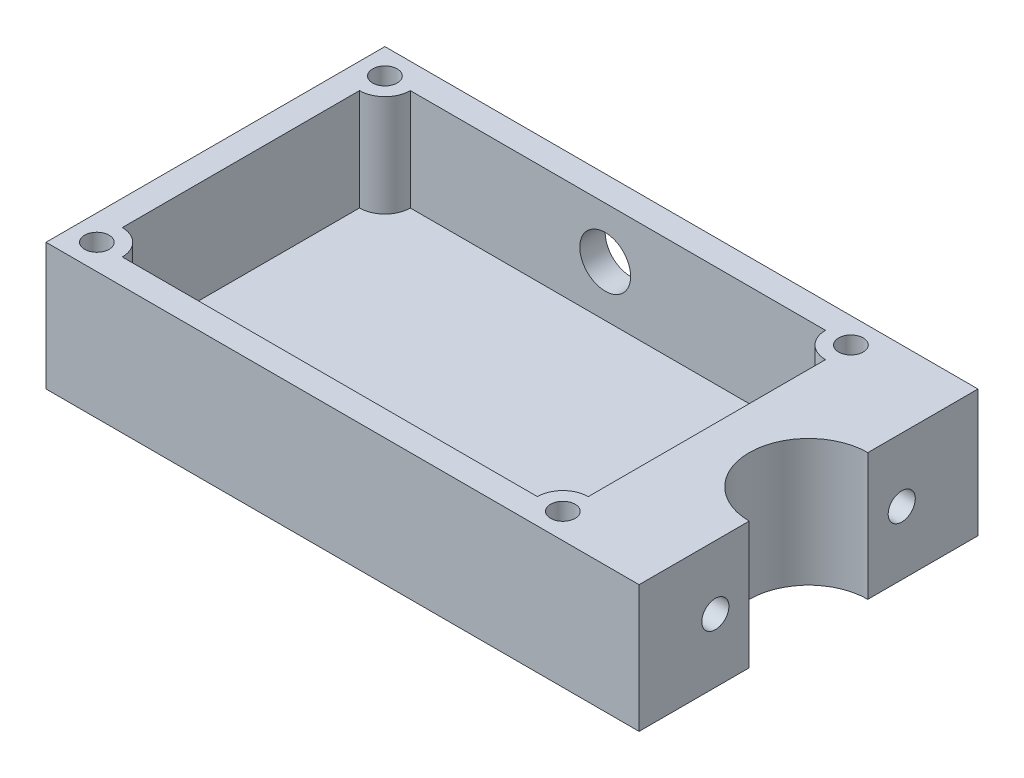
ISO-10303-21;
HEADER;
FILE_DESCRIPTION(('STEP AP214'),'2;1');
FILE_NAME('part.step','',(''),(''),'','','');
FILE_SCHEMA(('AUTOMOTIVE_DESIGN { 1 0 10303 214 1 1 1 1 }'));
ENDSEC;
DATA;
#1=APPLICATION_CONTEXT('core data for automotive mechanical design processes');
#2=APPLICATION_PROTOCOL_DEFINITION('international standard','automotive_design',2000,#1);
#3=PRODUCT_CONTEXT('',#1,'mechanical');
#4=PRODUCT('Part','Part','',(#3));
#5=PRODUCT_RELATED_PRODUCT_CATEGORY('part','',(#4));
#6=PRODUCT_DEFINITION_FORMATION('','',#4);
#7=PRODUCT_DEFINITION_CONTEXT('part definition',#1,'design');
#8=PRODUCT_DEFINITION('design','',#6,#7);
#9=PRODUCT_DEFINITION_SHAPE('','',#8);
#10=(LENGTH_UNIT() NAMED_UNIT(*) SI_UNIT(.MILLI.,.METRE.));
#11=(NAMED_UNIT(*) PLANE_ANGLE_UNIT() SI_UNIT($,.RADIAN.));
#12=(NAMED_UNIT(*) SI_UNIT($,.STERADIAN.) SOLID_ANGLE_UNIT());
#13=UNCERTAINTY_MEASURE_WITH_UNIT(LENGTH_MEASURE(1.E-05),#10,'distance_accuracy_value','');
#14=(GEOMETRIC_REPRESENTATION_CONTEXT(3) GLOBAL_UNCERTAINTY_ASSIGNED_CONTEXT((#13)) GLOBAL_UNIT_ASSIGNED_CONTEXT((#10,
#11,#12)) REPRESENTATION_CONTEXT('',''));
#15=CARTESIAN_POINT('',(0.,0.,0.));
#16=DIRECTION('',(0.,0.,1.));
#17=DIRECTION('',(1.,0.,0.));
#18=AXIS2_PLACEMENT_3D('',#15,#16,#17);
#19=CARTESIAN_POINT('',(-35.001,7.49999999999999,11.));
#20=DIRECTION('',(1.,0.,0.));
#21=DIRECTION('',(0.,0.,-1.));
#22=AXIS2_PLACEMENT_3D('',#19,#20,#21);
#23=CYLINDRICAL_SURFACE('',#22,1.6);
#24=CARTESIAN_POINT('',(35.,7.49999999999999,11.));
#25=DIRECTION('',(1.,0.,0.));
#26=DIRECTION('',(0.,0.,-1.));
#27=AXIS2_PLACEMENT_3D('',#24,#25,#26);
#28=CIRCLE('',#27,1.6);
#29=CARTESIAN_POINT('',(35.,7.49999999999999,9.4));
#30=VERTEX_POINT('',#29);
#31=EDGE_CURVE('E366',#30,#30,#28,.T.);
#32=ORIENTED_EDGE('',*,*,#31,.T.);
#33=EDGE_LOOP('',(#32));
#34=FACE_BOUND('',#33,.T.);
#35=CARTESIAN_POINT('',(27.,7.49999999999999,11.));
#36=DIRECTION('',(-1.,0.,0.));
#37=DIRECTION('',(0.,0.,1.));
#38=AXIS2_PLACEMENT_3D('',#35,#36,#37);
#39=CIRCLE('',#38,1.6);
#40=CARTESIAN_POINT('',(27.,7.49999999999999,12.6));
#41=VERTEX_POINT('',#40);
#42=EDGE_CURVE('E41',#41,#41,#39,.F.);
#43=ORIENTED_EDGE('',*,*,#42,.F.);
#44=EDGE_LOOP('',(#43));
#45=FACE_BOUND('',#44,.T.);
#46=ADVANCED_FACE('F37',(#34,#45),#23,.F.);
#47=CARTESIAN_POINT('',(-35.001,7.5,-11.));
#48=DIRECTION('',(1.,0.,0.));
#49=DIRECTION('',(0.,0.,-1.));
#50=AXIS2_PLACEMENT_3D('',#47,#48,#49);
#51=CYLINDRICAL_SURFACE('',#50,1.6);
#52=CARTESIAN_POINT('',(35.,7.5,-11.));
#53=DIRECTION('',(1.,0.,0.));
#54=DIRECTION('',(0.,0.,-1.));
#55=AXIS2_PLACEMENT_3D('',#52,#53,#54);
#56=CIRCLE('',#55,1.6);
#57=CARTESIAN_POINT('',(35.,7.5,-12.6));
#58=VERTEX_POINT('',#57);
#59=EDGE_CURVE('E369',#58,#58,#56,.T.);
#60=ORIENTED_EDGE('',*,*,#59,.T.);
#61=EDGE_LOOP('',(#60));
#62=FACE_BOUND('',#61,.T.);
#63=CARTESIAN_POINT('',(27.,7.5,-11.));
#64=DIRECTION('',(-1.,0.,0.));
#65=DIRECTION('',(0.,0.,1.));
#66=AXIS2_PLACEMENT_3D('',#63,#64,#65);
#67=CIRCLE('',#66,1.6);
#68=CARTESIAN_POINT('',(27.,7.5,-9.39999999999999));
#69=VERTEX_POINT('',#68);
#70=EDGE_CURVE('E355',#69,#69,#67,.F.);
#71=ORIENTED_EDGE('',*,*,#70,.F.);
#72=EDGE_LOOP('',(#71));
#73=FACE_BOUND('',#72,.T.);
#74=ADVANCED_FACE('F427',(#62,#73),#51,.F.);
#75=CARTESIAN_POINT('',(-35.,15.,20.));
#76=DIRECTION('',(1.,0.,0.));
#77=DIRECTION('',(0.,0.,-1.));
#78=AXIS2_PLACEMENT_3D('',#75,#76,#77);
#79=PLANE('',#78);
#80=DIRECTION('',(0.,0.,1.));
#81=VECTOR('',#80,1.);
#82=CARTESIAN_POINT('',(-35.,0.,20.));
#83=LINE('',#82,#81);
#84=CARTESIAN_POINT('',(-35.,0.,-20.));
#85=VERTEX_POINT('',#84);
#86=CARTESIAN_POINT('',(-35.,0.,20.));
#87=VERTEX_POINT('',#86);
#88=EDGE_CURVE('E383',#85,#87,#83,.T.);
#89=ORIENTED_EDGE('',*,*,#88,.T.);
#90=DIRECTION('',(0.,-1.,0.));
#91=VECTOR('',#90,1.);
#92=CARTESIAN_POINT('',(-35.,15.,20.));
#93=LINE('',#92,#91);
#94=CARTESIAN_POINT('',(-35.,15.,20.));
#95=VERTEX_POINT('',#94);
#96=EDGE_CURVE('E12',#95,#87,#93,.T.);
#97=ORIENTED_EDGE('',*,*,#96,.F.);
#98=DIRECTION('',(0.,0.,1.));
#99=VECTOR('',#98,1.);
#100=CARTESIAN_POINT('',(-35.,15.,20.));
#101=LINE('',#100,#99);
#102=CARTESIAN_POINT('',(-35.,15.,-20.));
#103=VERTEX_POINT('',#102);
#104=EDGE_CURVE('E384',#103,#95,#101,.T.);
#105=ORIENTED_EDGE('',*,*,#104,.F.);
#106=DIRECTION('',(0.,-1.,0.));
#107=VECTOR('',#106,1.);
#108=CARTESIAN_POINT('',(-35.,15.,-20.));
#109=LINE('',#108,#107);
#110=EDGE_CURVE('E398',#103,#85,#109,.T.);
#111=ORIENTED_EDGE('',*,*,#110,.T.);
#112=EDGE_LOOP('',(#89,#97,#105,#111));
#113=FACE_BOUND('',#112,.T.);
#114=ADVANCED_FACE('F39',(#113),#79,.F.);
#115=CARTESIAN_POINT('',(35.,15.,20.));
#116=DIRECTION('',(0.,0.,-1.));
#117=DIRECTION('',(-1.,0.,0.));
#118=AXIS2_PLACEMENT_3D('',#115,#116,#117);
#119=PLANE('',#118);
#120=DIRECTION('',(1.,0.,0.));
#121=VECTOR('',#120,1.);
#122=CARTESIAN_POINT('',(35.,0.,20.));
#123=LINE('',#122,#121);
#124=CARTESIAN_POINT('',(35.,0.,20.));
#125=VERTEX_POINT('',#124);
#126=EDGE_CURVE('E401',#87,#125,#123,.T.);
#127=ORIENTED_EDGE('',*,*,#126,.T.);
#128=DIRECTION('',(0.,-1.,0.));
#129=VECTOR('',#128,1.);
#130=CARTESIAN_POINT('',(35.,15.,20.));
#131=LINE('',#130,#129);
#132=CARTESIAN_POINT('',(35.,15.,20.));
#133=VERTEX_POINT('',#132);
#134=EDGE_CURVE('E46',#133,#125,#131,.T.);
#135=ORIENTED_EDGE('',*,*,#134,.F.);
#136=DIRECTION('',(1.,0.,0.));
#137=VECTOR('',#136,1.);
#138=CARTESIAN_POINT('',(35.,15.,20.));
#139=LINE('',#138,#137);
#140=EDGE_CURVE('E387',#95,#133,#139,.T.);
#141=ORIENTED_EDGE('',*,*,#140,.F.);
#142=ORIENTED_EDGE('',*,*,#96,.T.);
#143=EDGE_LOOP('',(#127,#135,#141,#142));
#144=FACE_BOUND('',#143,.T.);
#145=ADVANCED_FACE('F435',(#144),#119,.F.);
#146=CARTESIAN_POINT('',(35.,15.,7.));
#147=DIRECTION('',(-1.,0.,0.));
#148=DIRECTION('',(0.,0.,1.));
#149=AXIS2_PLACEMENT_3D('',#146,#147,#148);
#150=PLANE('',#149);
#151=ORIENTED_EDGE('',*,*,#31,.F.);
#152=EDGE_LOOP('',(#151));
#153=FACE_BOUND('',#152,.T.);
#154=DIRECTION('',(0.,0.,-1.));
#155=VECTOR('',#154,1.);
#156=CARTESIAN_POINT('',(35.,0.,7.));
#157=LINE('',#156,#155);
#158=CARTESIAN_POINT('',(35.,0.,7.));
#159=VERTEX_POINT('',#158);
#160=EDGE_CURVE('E403',#125,#159,#157,.T.);
#161=ORIENTED_EDGE('',*,*,#160,.T.);
#162=DIRECTION('',(0.,-1.,0.));
#163=VECTOR('',#162,1.);
#164=CARTESIAN_POINT('',(35.,15.,7.));
#165=LINE('',#164,#163);
#166=CARTESIAN_POINT('',(35.,15.,7.));
#167=VERTEX_POINT('',#166);
#168=EDGE_CURVE('E418',#167,#159,#165,.T.);
#169=ORIENTED_EDGE('',*,*,#168,.F.);
#170=DIRECTION('',(0.,0.,-1.));
#171=VECTOR('',#170,1.);
#172=CARTESIAN_POINT('',(35.,15.,7.));
#173=LINE('',#172,#171);
#174=EDGE_CURVE('E390',#133,#167,#173,.T.);
#175=ORIENTED_EDGE('',*,*,#174,.F.);
#176=ORIENTED_EDGE('',*,*,#134,.T.);
#177=EDGE_LOOP('',(#161,#169,#175,#176));
#178=FACE_BOUND('',#177,.T.);
#179=ADVANCED_FACE('F477',(#153,#178),#150,.F.);
#180=CARTESIAN_POINT('',(35.,15.,0.));
#181=DIRECTION('',(0.,-1.,0.));
#182=DIRECTION('',(0.,0.,-1.));
#183=AXIS2_PLACEMENT_3D('',#180,#181,#182);
#184=CYLINDRICAL_SURFACE('',#183,7.);
#185=CARTESIAN_POINT('',(35.,0.,0.));
#186=DIRECTION('',(0.,-1.,0.));
#187=DIRECTION('',(0.,0.,1.));
#188=AXIS2_PLACEMENT_3D('',#185,#186,#187);
#189=CIRCLE('',#188,7.);
#190=CARTESIAN_POINT('',(35.,0.,-7.));
#191=VERTEX_POINT('',#190);
#192=EDGE_CURVE('E405',#159,#191,#189,.T.);
#193=ORIENTED_EDGE('',*,*,#192,.T.);
#194=DIRECTION('',(0.,-1.,0.));
#195=VECTOR('',#194,1.);
#196=CARTESIAN_POINT('',(35.,15.,-7.));
#197=LINE('',#196,#195);
#198=CARTESIAN_POINT('',(35.,15.,-7.));
#199=VERTEX_POINT('',#198);
#200=EDGE_CURVE('E415',#199,#191,#197,.T.);
#201=ORIENTED_EDGE('',*,*,#200,.F.);
#202=CARTESIAN_POINT('',(35.,15.,0.));
#203=DIRECTION('',(0.,-1.,0.));
#204=DIRECTION('',(0.,0.,1.));
#205=AXIS2_PLACEMENT_3D('',#202,#203,#204);
#206=CIRCLE('',#205,7.);
#207=EDGE_CURVE('E392',#167,#199,#206,.T.);
#208=ORIENTED_EDGE('',*,*,#207,.F.);
#209=ORIENTED_EDGE('',*,*,#168,.T.);
#210=EDGE_LOOP('',(#193,#201,#208,#209));
#211=FACE_BOUND('',#210,.T.);
#212=ADVANCED_FACE('F473',(#211),#184,.F.);
#213=CARTESIAN_POINT('',(35.,15.,-20.));
#214=DIRECTION('',(-1.,0.,0.));
#215=DIRECTION('',(0.,0.,1.));
#216=AXIS2_PLACEMENT_3D('',#213,#214,#215);
#217=PLANE('',#216);
#218=ORIENTED_EDGE('',*,*,#59,.F.);
#219=EDGE_LOOP('',(#218));
#220=FACE_BOUND('',#219,.T.);
#221=DIRECTION('',(0.,0.,-1.));
#222=VECTOR('',#221,1.);
#223=CARTESIAN_POINT('',(35.,0.,-20.));
#224=LINE('',#223,#222);
#225=CARTESIAN_POINT('',(35.,0.,-20.));
#226=VERTEX_POINT('',#225);
#227=EDGE_CURVE('E407',#191,#226,#224,.T.);
#228=ORIENTED_EDGE('',*,*,#227,.T.);
#229=DIRECTION('',(0.,-1.,0.));
#230=VECTOR('',#229,1.);
#231=CARTESIAN_POINT('',(35.,15.,-20.));
#232=LINE('',#231,#230);
#233=CARTESIAN_POINT('',(35.,15.,-20.));
#234=VERTEX_POINT('',#233);
#235=EDGE_CURVE('E412',#234,#226,#232,.T.);
#236=ORIENTED_EDGE('',*,*,#235,.F.);
#237=DIRECTION('',(0.,0.,-1.));
#238=VECTOR('',#237,1.);
#239=CARTESIAN_POINT('',(35.,15.,-20.));
#240=LINE('',#239,#238);
#241=EDGE_CURVE('E394',#199,#234,#240,.T.);
#242=ORIENTED_EDGE('',*,*,#241,.F.);
#243=ORIENTED_EDGE('',*,*,#200,.T.);
#244=EDGE_LOOP('',(#228,#236,#242,#243));
#245=FACE_BOUND('',#244,.T.);
#246=ADVANCED_FACE('F469',(#220,#245),#217,.F.);
#247=CARTESIAN_POINT('',(35.,15.,-20.));
#248=DIRECTION('',(0.,0.,1.));
#249=DIRECTION('',(1.,0.,0.));
#250=AXIS2_PLACEMENT_3D('',#247,#248,#249);
#251=PLANE('',#250);
#252=CARTESIAN_POINT('',(-6.,8.99999999999165,-20.));
#253=DIRECTION('',(0.,0.,1.));
#254=DIRECTION('',(1.,0.,0.));
#255=AXIS2_PLACEMENT_3D('',#252,#253,#254);
#256=CIRCLE('',#255,3.);
#257=CARTESIAN_POINT('',(-3.,8.99999999999165,-20.));
#258=VERTEX_POINT('',#257);
#259=EDGE_CURVE('E821',#258,#258,#256,.T.);
#260=ORIENTED_EDGE('',*,*,#259,.T.);
#261=EDGE_LOOP('',(#260));
#262=FACE_BOUND('',#261,.T.);
#263=DIRECTION('',(-1.,0.,0.));
#264=VECTOR('',#263,1.);
#265=CARTESIAN_POINT('',(35.,0.,-20.));
#266=LINE('',#265,#264);
#267=EDGE_CURVE('E388',#226,#85,#266,.T.);
#268=ORIENTED_EDGE('',*,*,#267,.T.);
#269=ORIENTED_EDGE('',*,*,#110,.F.);
#270=DIRECTION('',(-1.,0.,0.));
#271=VECTOR('',#270,1.);
#272=CARTESIAN_POINT('',(35.,15.,-20.));
#273=LINE('',#272,#271);
#274=EDGE_CURVE('E396',#234,#103,#273,.T.);
#275=ORIENTED_EDGE('',*,*,#274,.F.);
#276=ORIENTED_EDGE('',*,*,#235,.T.);
#277=EDGE_LOOP('',(#268,#269,#275,#276));
#278=FACE_BOUND('',#277,.T.);
#279=ADVANCED_FACE('F462',(#262,#278),#251,.F.);
#280=CARTESIAN_POINT('',(35.,15.,0.));
#281=DIRECTION('',(0.,1.,0.));
#282=DIRECTION('',(0.,0.,1.));
#283=AXIS2_PLACEMENT_3D('',#280,#281,#282);
#284=PLANE('',#283);
#285=CARTESIAN_POINT('',(23.,15.,-17.));
#286=DIRECTION('',(0.,1.,0.));
#287=DIRECTION('',(0.,0.,1.));
#288=AXIS2_PLACEMENT_3D('',#285,#286,#287);
#289=CIRCLE('',#288,1.45);
#290=CARTESIAN_POINT('',(23.,15.,-15.55));
#291=VERTEX_POINT('',#290);
#292=EDGE_CURVE('E832',#291,#291,#289,.T.);
#293=ORIENTED_EDGE('',*,*,#292,.F.);
#294=EDGE_LOOP('',(#293));
#295=FACE_BOUND('',#294,.T.);
#296=CARTESIAN_POINT('',(23.,15.,17.));
#297=DIRECTION('',(0.,1.,0.));
#298=DIRECTION('',(0.,0.,1.));
#299=AXIS2_PLACEMENT_3D('',#296,#297,#298);
#300=CIRCLE('',#299,1.45);
#301=CARTESIAN_POINT('',(23.,15.,18.45));
#302=VERTEX_POINT('',#301);
#303=EDGE_CURVE('E838',#302,#302,#300,.T.);
#304=ORIENTED_EDGE('',*,*,#303,.F.);
#305=EDGE_LOOP('',(#304));
#306=FACE_BOUND('',#305,.T.);
#307=CARTESIAN_POINT('',(-32.,15.,17.));
#308=DIRECTION('',(0.,1.,0.));
#309=DIRECTION('',(0.,0.,1.));
#310=AXIS2_PLACEMENT_3D('',#307,#308,#309);
#311=CIRCLE('',#310,1.45);
#312=CARTESIAN_POINT('',(-32.,15.,18.45));
#313=VERTEX_POINT('',#312);
#314=EDGE_CURVE('E826',#313,#313,#311,.T.);
#315=ORIENTED_EDGE('',*,*,#314,.F.);
#316=EDGE_LOOP('',(#315));
#317=FACE_BOUND('',#316,.T.);
#318=CARTESIAN_POINT('',(-32.,15.,-17.));
#319=DIRECTION('',(0.,1.,0.));
#320=DIRECTION('',(0.,0.,1.));
#321=AXIS2_PLACEMENT_3D('',#318,#319,#320);
#322=CIRCLE('',#321,1.45);
#323=CARTESIAN_POINT('',(-32.,15.,-15.55));
#324=VERTEX_POINT('',#323);
#325=EDGE_CURVE('E235',#324,#324,#322,.T.);
#326=ORIENTED_EDGE('',*,*,#325,.F.);
#327=EDGE_LOOP('',(#326));
#328=FACE_BOUND('',#327,.T.);
#329=DIRECTION('',(-1.,0.,0.));
#330=VECTOR('',#329,1.);
#331=CARTESIAN_POINT('',(23.,15.,-17.));
#332=LINE('',#331,#330);
#333=CARTESIAN_POINT('',(20.,15.,-17.));
#334=VERTEX_POINT('',#333);
#335=CARTESIAN_POINT('',(-29.,15.,-17.));
#336=VERTEX_POINT('',#335);
#337=EDGE_CURVE('E221',#334,#336,#332,.T.);
#338=ORIENTED_EDGE('',*,*,#337,.F.);
#339=CARTESIAN_POINT('',(23.,15.,-17.));
#340=DIRECTION('',(0.,1.,0.));
#341=DIRECTION('',(0.,0.,-1.));
#342=AXIS2_PLACEMENT_3D('',#339,#340,#341);
#343=CIRCLE('',#342,3.);
#344=CARTESIAN_POINT('',(23.,15.,-14.));
#345=VERTEX_POINT('',#344);
#346=EDGE_CURVE('E228',#334,#345,#343,.T.);
#347=ORIENTED_EDGE('',*,*,#346,.T.);
#348=DIRECTION('',(0.,0.,-1.));
#349=VECTOR('',#348,1.);
#350=CARTESIAN_POINT('',(23.,15.,17.));
#351=LINE('',#350,#349);
#352=CARTESIAN_POINT('',(23.,15.,14.));
#353=VERTEX_POINT('',#352);
#354=EDGE_CURVE('E62',#353,#345,#351,.T.);
#355=ORIENTED_EDGE('',*,*,#354,.F.);
#356=CARTESIAN_POINT('',(23.,15.,17.));
#357=DIRECTION('',(0.,1.,0.));
#358=DIRECTION('',(0.,0.,-1.));
#359=AXIS2_PLACEMENT_3D('',#356,#357,#358);
#360=CIRCLE('',#359,3.);
#361=CARTESIAN_POINT('',(20.,15.,17.));
#362=VERTEX_POINT('',#361);
#363=EDGE_CURVE('E238',#353,#362,#360,.T.);
#364=ORIENTED_EDGE('',*,*,#363,.T.);
#365=DIRECTION('',(1.,0.,0.));
#366=VECTOR('',#365,1.);
#367=CARTESIAN_POINT('',(23.,15.,17.));
#368=LINE('',#367,#366);
#369=CARTESIAN_POINT('',(-29.,15.,17.));
#370=VERTEX_POINT('',#369);
#371=EDGE_CURVE('E378',#370,#362,#368,.T.);
#372=ORIENTED_EDGE('',*,*,#371,.F.);
#373=CARTESIAN_POINT('',(-32.,15.,17.));
#374=DIRECTION('',(0.,1.,0.));
#375=DIRECTION('',(0.,0.,-1.));
#376=AXIS2_PLACEMENT_3D('',#373,#374,#375);
#377=CIRCLE('',#376,3.);
#378=CARTESIAN_POINT('',(-32.,15.,14.));
#379=VERTEX_POINT('',#378);
#380=EDGE_CURVE('E248',#370,#379,#377,.T.);
#381=ORIENTED_EDGE('',*,*,#380,.T.);
#382=DIRECTION('',(0.,0.,1.));
#383=VECTOR('',#382,1.);
#384=CARTESIAN_POINT('',(-32.,15.,17.));
#385=LINE('',#384,#383);
#386=CARTESIAN_POINT('',(-32.,15.,-14.));
#387=VERTEX_POINT('',#386);
#388=EDGE_CURVE('E371',#387,#379,#385,.T.);
#389=ORIENTED_EDGE('',*,*,#388,.F.);
#390=CARTESIAN_POINT('',(-32.,15.,-17.));
#391=DIRECTION('',(0.,1.,0.));
#392=DIRECTION('',(0.,0.,-1.));
#393=AXIS2_PLACEMENT_3D('',#390,#391,#392);
#394=CIRCLE('',#393,3.);
#395=EDGE_CURVE('E259',#387,#336,#394,.T.);
#396=ORIENTED_EDGE('',*,*,#395,.T.);
#397=EDGE_LOOP('',(#338,#347,#355,#364,#372,#381,#389,#396));
#398=FACE_BOUND('',#397,.T.);
#399=ORIENTED_EDGE('',*,*,#104,.T.);
#400=ORIENTED_EDGE('',*,*,#140,.T.);
#401=ORIENTED_EDGE('',*,*,#174,.T.);
#402=ORIENTED_EDGE('',*,*,#207,.T.);
#403=ORIENTED_EDGE('',*,*,#241,.T.);
#404=ORIENTED_EDGE('',*,*,#274,.T.);
#405=EDGE_LOOP('',(#399,#400,#401,#402,#403,#404));
#406=FACE_BOUND('',#405,.T.);
#407=ADVANCED_FACE('F459',(#295,#306,#317,#328,#398,#406),#284,.T.);
#408=CARTESIAN_POINT('',(35.,0.,0.));
#409=DIRECTION('',(0.,1.,0.));
#410=DIRECTION('',(0.,0.,1.));
#411=AXIS2_PLACEMENT_3D('',#408,#409,#410);
#412=PLANE('',#411);
#413=CARTESIAN_POINT('',(23.,0.,-17.));
#414=DIRECTION('',(0.,1.,0.));
#415=DIRECTION('',(0.,0.,1.));
#416=AXIS2_PLACEMENT_3D('',#413,#414,#415);
#417=CIRCLE('',#416,1.45);
#418=CARTESIAN_POINT('',(23.,0.,-15.55));
#419=VERTEX_POINT('',#418);
#420=EDGE_CURVE('E829',#419,#419,#417,.T.);
#421=ORIENTED_EDGE('',*,*,#420,.T.);
#422=EDGE_LOOP('',(#421));
#423=FACE_BOUND('',#422,.T.);
#424=CARTESIAN_POINT('',(23.,0.,17.));
#425=DIRECTION('',(0.,1.,0.));
#426=DIRECTION('',(0.,0.,1.));
#427=AXIS2_PLACEMENT_3D('',#424,#425,#426);
#428=CIRCLE('',#427,1.45);
#429=CARTESIAN_POINT('',(23.,0.,18.45));
#430=VERTEX_POINT('',#429);
#431=EDGE_CURVE('E835',#430,#430,#428,.T.);
#432=ORIENTED_EDGE('',*,*,#431,.T.);
#433=EDGE_LOOP('',(#432));
#434=FACE_BOUND('',#433,.T.);
#435=CARTESIAN_POINT('',(-32.,0.,17.));
#436=DIRECTION('',(0.,1.,0.));
#437=DIRECTION('',(0.,0.,1.));
#438=AXIS2_PLACEMENT_3D('',#435,#436,#437);
#439=CIRCLE('',#438,1.45);
#440=CARTESIAN_POINT('',(-32.,0.,18.45));
#441=VERTEX_POINT('',#440);
#442=EDGE_CURVE('E841',#441,#441,#439,.T.);
#443=ORIENTED_EDGE('',*,*,#442,.T.);
#444=EDGE_LOOP('',(#443));
#445=FACE_BOUND('',#444,.T.);
#446=CARTESIAN_POINT('',(-32.,0.,-17.));
#447=DIRECTION('',(0.,1.,0.));
#448=DIRECTION('',(0.,0.,1.));
#449=AXIS2_PLACEMENT_3D('',#446,#447,#448);
#450=CIRCLE('',#449,1.45);
#451=CARTESIAN_POINT('',(-32.,0.,-15.55));
#452=VERTEX_POINT('',#451);
#453=EDGE_CURVE('E231',#452,#452,#450,.T.);
#454=ORIENTED_EDGE('',*,*,#453,.T.);
#455=EDGE_LOOP('',(#454));
#456=FACE_BOUND('',#455,.T.);
#457=ORIENTED_EDGE('',*,*,#88,.F.);
#458=ORIENTED_EDGE('',*,*,#267,.F.);
#459=ORIENTED_EDGE('',*,*,#227,.F.);
#460=ORIENTED_EDGE('',*,*,#192,.F.);
#461=ORIENTED_EDGE('',*,*,#160,.F.);
#462=ORIENTED_EDGE('',*,*,#126,.F.);
#463=EDGE_LOOP('',(#457,#458,#459,#460,#461,#462));
#464=FACE_BOUND('',#463,.T.);
#465=ADVANCED_FACE('F457',(#423,#434,#445,#456,#464),#412,.F.);
#466=CARTESIAN_POINT('',(-32.,-64.6606526413088,17.));
#467=DIRECTION('',(-1.,0.,0.));
#468=DIRECTION('',(0.,0.,1.));
#469=AXIS2_PLACEMENT_3D('',#466,#467,#468);
#470=PLANE('',#469);
#471=ORIENTED_EDGE('',*,*,#388,.T.);
#472=DIRECTION('',(0.,1.,0.));
#473=VECTOR('',#472,1.);
#474=CARTESIAN_POINT('',(-32.,-500000.,14.));
#475=LINE('',#474,#473);
#476=CARTESIAN_POINT('',(-32.,2.9999999999859,14.));
#477=VERTEX_POINT('',#476);
#478=EDGE_CURVE('E252',#477,#379,#475,.T.);
#479=ORIENTED_EDGE('',*,*,#478,.F.);
#480=DIRECTION('',(0.,0.,-1.));
#481=VECTOR('',#480,1.);
#482=CARTESIAN_POINT('',(-32.,3.,17.));
#483=LINE('',#482,#481);
#484=CARTESIAN_POINT('',(-32.,3.,-14.));
#485=VERTEX_POINT('',#484);
#486=EDGE_CURVE('E374',#477,#485,#483,.T.);
#487=ORIENTED_EDGE('',*,*,#486,.T.);
#488=DIRECTION('',(0.,1.,0.));
#489=VECTOR('',#488,1.);
#490=CARTESIAN_POINT('',(-32.,-500000.,-14.));
#491=LINE('',#490,#489);
#492=EDGE_CURVE('E264',#485,#387,#491,.T.);
#493=ORIENTED_EDGE('',*,*,#492,.T.);
#494=EDGE_LOOP('',(#471,#479,#487,#493));
#495=FACE_BOUND('',#494,.T.);
#496=ADVANCED_FACE('F447',(#495),#470,.F.);
#497=CARTESIAN_POINT('',(23.,-64.6606526413088,-17.));
#498=DIRECTION('',(0.,0.,-1.));
#499=DIRECTION('',(-1.,0.,0.));
#500=AXIS2_PLACEMENT_3D('',#497,#498,#499);
#501=PLANE('',#500);
#502=CARTESIAN_POINT('',(-6.,8.99999999999165,-17.));
#503=DIRECTION('',(0.,0.,1.));
#504=DIRECTION('',(1.,0.,0.));
#505=AXIS2_PLACEMENT_3D('',#502,#503,#504);
#506=CIRCLE('',#505,3.);
#507=CARTESIAN_POINT('',(-3.,8.99999999999165,-17.));
#508=VERTEX_POINT('',#507);
#509=EDGE_CURVE('E824',#508,#508,#506,.T.);
#510=ORIENTED_EDGE('',*,*,#509,.F.);
#511=EDGE_LOOP('',(#510));
#512=FACE_BOUND('',#511,.T.);
#513=DIRECTION('',(1.,0.,0.));
#514=VECTOR('',#513,1.);
#515=CARTESIAN_POINT('',(23.,3.,-17.));
#516=LINE('',#515,#514);
#517=CARTESIAN_POINT('',(-29.,2.9999999999859,-17.));
#518=VERTEX_POINT('',#517);
#519=CARTESIAN_POINT('',(20.,3.,-17.));
#520=VERTEX_POINT('',#519);
#521=EDGE_CURVE('E220',#518,#520,#516,.T.);
#522=ORIENTED_EDGE('',*,*,#521,.T.);
#523=DIRECTION('',(0.,1.,0.));
#524=VECTOR('',#523,1.);
#525=CARTESIAN_POINT('',(20.,-500000.,-17.));
#526=LINE('',#525,#524);
#527=EDGE_CURVE('E54',#520,#334,#526,.T.);
#528=ORIENTED_EDGE('',*,*,#527,.T.);
#529=ORIENTED_EDGE('',*,*,#337,.T.);
#530=DIRECTION('',(0.,1.,0.));
#531=VECTOR('',#530,1.);
#532=CARTESIAN_POINT('',(-29.,-500000.,-17.));
#533=LINE('',#532,#531);
#534=EDGE_CURVE('E263',#518,#336,#533,.T.);
#535=ORIENTED_EDGE('',*,*,#534,.F.);
#536=EDGE_LOOP('',(#522,#528,#529,#535));
#537=FACE_BOUND('',#536,.T.);
#538=ADVANCED_FACE('F444',(#512,#537),#501,.F.);
#539=CARTESIAN_POINT('',(23.,-64.6606526413088,17.));
#540=DIRECTION('',(1.,0.,0.));
#541=DIRECTION('',(0.,0.,-1.));
#542=AXIS2_PLACEMENT_3D('',#539,#540,#541);
#543=PLANE('',#542);
#544=DIRECTION('',(0.,-1.,0.));
#545=VECTOR('',#544,1.);
#546=CARTESIAN_POINT('',(23.,9.12499999999999,8.18541743770058));
#547=LINE('',#546,#545);
#548=CARTESIAN_POINT('',(23.,9.12499999999999,8.18541743770058));
#549=VERTEX_POINT('',#548);
#550=CARTESIAN_POINT('',(23.,5.875,8.18541743770058));
#551=VERTEX_POINT('',#550);
#552=EDGE_CURVE('E291',#549,#551,#547,.T.);
#553=ORIENTED_EDGE('',*,*,#552,.F.);
#554=DIRECTION('',(0.,-0.5,-0.866025403784439));
#555=VECTOR('',#554,1.);
#556=CARTESIAN_POINT('',(23.,10.75,11.));
#557=LINE('',#556,#555);
#558=CARTESIAN_POINT('',(23.,10.75,11.));
#559=VERTEX_POINT('',#558);
#560=EDGE_CURVE('E262',#559,#549,#557,.T.);
#561=ORIENTED_EDGE('',*,*,#560,.F.);
#562=DIRECTION('',(0.,0.5,-0.866025403784439));
#563=VECTOR('',#562,1.);
#564=CARTESIAN_POINT('',(23.,9.12499999999999,13.8145825622994));
#565=LINE('',#564,#563);
#566=CARTESIAN_POINT('',(23.,9.12499999999999,13.8145825622994));
#567=VERTEX_POINT('',#566);
#568=EDGE_CURVE('E274',#567,#559,#565,.T.);
#569=ORIENTED_EDGE('',*,*,#568,.F.);
#570=DIRECTION('',(0.,1.,0.));
#571=VECTOR('',#570,1.);
#572=CARTESIAN_POINT('',(23.,5.87499999999999,13.8145825622994));
#573=LINE('',#572,#571);
#574=CARTESIAN_POINT('',(23.,5.87499999999999,13.8145825622994));
#575=VERTEX_POINT('',#574);
#576=EDGE_CURVE('E300',#575,#567,#573,.T.);
#577=ORIENTED_EDGE('',*,*,#576,.F.);
#578=DIRECTION('',(0.,0.5,0.866025403784439));
#579=VECTOR('',#578,1.);
#580=CARTESIAN_POINT('',(23.,4.25,11.));
#581=LINE('',#580,#579);
#582=CARTESIAN_POINT('',(23.,4.25,11.));
#583=VERTEX_POINT('',#582);
#584=EDGE_CURVE('E297',#583,#575,#581,.T.);
#585=ORIENTED_EDGE('',*,*,#584,.F.);
#586=DIRECTION('',(0.,-0.5,0.866025403784439));
#587=VECTOR('',#586,1.);
#588=CARTESIAN_POINT('',(23.,5.875,8.18541743770058));
#589=LINE('',#588,#587);
#590=EDGE_CURVE('E294',#551,#583,#589,.T.);
#591=ORIENTED_EDGE('',*,*,#590,.F.);
#592=EDGE_LOOP('',(#553,#561,#569,#577,#585,#591));
#593=FACE_BOUND('',#592,.T.);
#594=DIRECTION('',(0.,-0.500000000000001,-0.866025403784438));
#595=VECTOR('',#594,1.);
#596=CARTESIAN_POINT('',(23.,10.75,-11.));
#597=LINE('',#596,#595);
#598=CARTESIAN_POINT('',(23.,10.75,-11.));
#599=VERTEX_POINT('',#598);
#600=CARTESIAN_POINT('',(23.,9.125,-13.8145825622994));
#601=VERTEX_POINT('',#600);
#602=EDGE_CURVE('E339',#599,#601,#597,.T.);
#603=ORIENTED_EDGE('',*,*,#602,.F.);
#604=DIRECTION('',(0.,0.5,-0.866025403784438));
#605=VECTOR('',#604,1.);
#606=CARTESIAN_POINT('',(23.,9.125,-8.18541743770057));
#607=LINE('',#606,#605);
#608=CARTESIAN_POINT('',(23.,9.125,-8.18541743770057));
#609=VERTEX_POINT('',#608);
#610=EDGE_CURVE('E337',#609,#599,#607,.T.);
#611=ORIENTED_EDGE('',*,*,#610,.F.);
#612=DIRECTION('',(0.,1.,0.));
#613=VECTOR('',#612,1.);
#614=CARTESIAN_POINT('',(23.,5.875,-8.18541743770057));
#615=LINE('',#614,#613);
#616=CARTESIAN_POINT('',(23.,5.875,-8.18541743770057));
#617=VERTEX_POINT('',#616);
#618=EDGE_CURVE('E321',#617,#609,#615,.T.);
#619=ORIENTED_EDGE('',*,*,#618,.F.);
#620=DIRECTION('',(0.,0.5,0.866025403784439));
#621=VECTOR('',#620,1.);
#622=CARTESIAN_POINT('',(23.,4.25,-11.));
#623=LINE('',#622,#621);
#624=CARTESIAN_POINT('',(23.,4.25,-11.));
#625=VERTEX_POINT('',#624);
#626=EDGE_CURVE('E348',#625,#617,#623,.T.);
#627=ORIENTED_EDGE('',*,*,#626,.F.);
#628=DIRECTION('',(0.,-0.5,0.866025403784439));
#629=VECTOR('',#628,1.);
#630=CARTESIAN_POINT('',(23.,5.875,-13.8145825622994));
#631=LINE('',#630,#629);
#632=CARTESIAN_POINT('',(23.,5.875,-13.8145825622994));
#633=VERTEX_POINT('',#632);
#634=EDGE_CURVE('E345',#633,#625,#631,.T.);
#635=ORIENTED_EDGE('',*,*,#634,.F.);
#636=DIRECTION('',(0.,-1.,0.));
#637=VECTOR('',#636,1.);
#638=CARTESIAN_POINT('',(23.,9.125,-13.8145825622994));
#639=LINE('',#638,#637);
#640=EDGE_CURVE('E342',#601,#633,#639,.T.);
#641=ORIENTED_EDGE('',*,*,#640,.F.);
#642=EDGE_LOOP('',(#603,#611,#619,#627,#635,#641));
#643=FACE_BOUND('',#642,.T.);
#644=ORIENTED_EDGE('',*,*,#354,.T.);
#645=DIRECTION('',(0.,1.,0.));
#646=VECTOR('',#645,1.);
#647=CARTESIAN_POINT('',(23.,-500000.,-14.));
#648=LINE('',#647,#646);
#649=CARTESIAN_POINT('',(23.,2.9999999999859,-14.));
#650=VERTEX_POINT('',#649);
#651=EDGE_CURVE('E223',#650,#345,#648,.T.);
#652=ORIENTED_EDGE('',*,*,#651,.F.);
#653=DIRECTION('',(0.,0.,1.));
#654=VECTOR('',#653,1.);
#655=CARTESIAN_POINT('',(23.,3.,17.));
#656=LINE('',#655,#654);
#657=CARTESIAN_POINT('',(23.,3.,14.));
#658=VERTEX_POINT('',#657);
#659=EDGE_CURVE('E213',#650,#658,#656,.T.);
#660=ORIENTED_EDGE('',*,*,#659,.T.);
#661=DIRECTION('',(0.,1.,0.));
#662=VECTOR('',#661,1.);
#663=CARTESIAN_POINT('',(23.,-500000.,14.));
#664=LINE('',#663,#662);
#665=EDGE_CURVE('E243',#658,#353,#664,.T.);
#666=ORIENTED_EDGE('',*,*,#665,.T.);
#667=EDGE_LOOP('',(#644,#652,#660,#666));
#668=FACE_BOUND('',#667,.T.);
#669=ADVANCED_FACE('F224',(#593,#643,#668),#543,.F.);
#670=CARTESIAN_POINT('',(23.,-64.6606526413088,17.));
#671=DIRECTION('',(0.,0.,1.));
#672=DIRECTION('',(1.,0.,0.));
#673=AXIS2_PLACEMENT_3D('',#670,#671,#672);
#674=PLANE('',#673);
#675=ORIENTED_EDGE('',*,*,#371,.T.);
#676=DIRECTION('',(0.,1.,0.));
#677=VECTOR('',#676,1.);
#678=CARTESIAN_POINT('',(20.,-500000.,17.));
#679=LINE('',#678,#677);
#680=CARTESIAN_POINT('',(20.,2.9999999999859,17.));
#681=VERTEX_POINT('',#680);
#682=EDGE_CURVE('E242',#681,#362,#679,.T.);
#683=ORIENTED_EDGE('',*,*,#682,.F.);
#684=DIRECTION('',(-1.,0.,0.));
#685=VECTOR('',#684,1.);
#686=CARTESIAN_POINT('',(23.,3.,17.));
#687=LINE('',#686,#685);
#688=CARTESIAN_POINT('',(-29.,2.9999999999859,17.));
#689=VERTEX_POINT('',#688);
#690=EDGE_CURVE('E376',#681,#689,#687,.T.);
#691=ORIENTED_EDGE('',*,*,#690,.T.);
#692=DIRECTION('',(0.,1.,0.));
#693=VECTOR('',#692,1.);
#694=CARTESIAN_POINT('',(-29.,-500000.,17.));
#695=LINE('',#694,#693);
#696=EDGE_CURVE('E253',#689,#370,#695,.T.);
#697=ORIENTED_EDGE('',*,*,#696,.T.);
#698=EDGE_LOOP('',(#675,#683,#691,#697));
#699=FACE_BOUND('',#698,.T.);
#700=ADVANCED_FACE('F443',(#699),#674,.F.);
#701=CARTESIAN_POINT('',(35.,3.,0.));
#702=DIRECTION('',(0.,1.,0.));
#703=DIRECTION('',(0.,0.,1.));
#704=AXIS2_PLACEMENT_3D('',#701,#702,#703);
#705=PLANE('',#704);
#706=CARTESIAN_POINT('',(23.,2.9999999999859,-17.));
#707=DIRECTION('',(0.,1.,0.));
#708=DIRECTION('',(0.,0.,1.));
#709=AXIS2_PLACEMENT_3D('',#706,#707,#708);
#710=CIRCLE('',#709,3.);
#711=EDGE_CURVE('E216',#650,#520,#710,.F.);
#712=ORIENTED_EDGE('',*,*,#711,.T.);
#713=ORIENTED_EDGE('',*,*,#521,.F.);
#714=CARTESIAN_POINT('',(-32.,2.9999999999859,-17.));
#715=DIRECTION('',(0.,1.,0.));
#716=DIRECTION('',(0.,0.,1.));
#717=AXIS2_PLACEMENT_3D('',#714,#715,#716);
#718=CIRCLE('',#717,3.);
#719=EDGE_CURVE('E251',#518,#485,#718,.F.);
#720=ORIENTED_EDGE('',*,*,#719,.T.);
#721=ORIENTED_EDGE('',*,*,#486,.F.);
#722=CARTESIAN_POINT('',(-32.,2.9999999999859,17.));
#723=DIRECTION('',(0.,1.,0.));
#724=DIRECTION('',(0.,0.,1.));
#725=AXIS2_PLACEMENT_3D('',#722,#723,#724);
#726=CIRCLE('',#725,3.);
#727=EDGE_CURVE('E241',#477,#689,#726,.F.);
#728=ORIENTED_EDGE('',*,*,#727,.T.);
#729=ORIENTED_EDGE('',*,*,#690,.F.);
#730=CARTESIAN_POINT('',(23.,2.9999999999859,17.));
#731=DIRECTION('',(0.,1.,0.));
#732=DIRECTION('',(0.,0.,1.));
#733=AXIS2_PLACEMENT_3D('',#730,#731,#732);
#734=CIRCLE('',#733,3.);
#735=EDGE_CURVE('E218',#681,#658,#734,.F.);
#736=ORIENTED_EDGE('',*,*,#735,.T.);
#737=ORIENTED_EDGE('',*,*,#659,.F.);
#738=EDGE_LOOP('',(#712,#713,#720,#721,#728,#729,#736,#737));
#739=FACE_BOUND('',#738,.T.);
#740=ADVANCED_FACE('F214',(#739),#705,.T.);
#741=CARTESIAN_POINT('',(27.,0.,0.));
#742=DIRECTION('',(-1.,0.,0.));
#743=DIRECTION('',(0.,0.,1.));
#744=AXIS2_PLACEMENT_3D('',#741,#742,#743);
#745=PLANE('',#744);
#746=DIRECTION('',(0.,0.5,-0.866025403784438));
#747=VECTOR('',#746,1.);
#748=CARTESIAN_POINT('',(27.,9.125,-8.18541743770057));
#749=LINE('',#748,#747);
#750=CARTESIAN_POINT('',(27.,9.125,-8.18541743770057));
#751=VERTEX_POINT('',#750);
#752=CARTESIAN_POINT('',(27.,10.75,-11.));
#753=VERTEX_POINT('',#752);
#754=EDGE_CURVE('E317',#751,#753,#749,.T.);
#755=ORIENTED_EDGE('',*,*,#754,.T.);
#756=DIRECTION('',(0.,-0.500000000000001,-0.866025403784438));
#757=VECTOR('',#756,1.);
#758=CARTESIAN_POINT('',(27.,10.75,-11.));
#759=LINE('',#758,#757);
#760=CARTESIAN_POINT('',(27.,9.125,-13.8145825622994));
#761=VERTEX_POINT('',#760);
#762=EDGE_CURVE('E320',#753,#761,#759,.T.);
#763=ORIENTED_EDGE('',*,*,#762,.T.);
#764=DIRECTION('',(0.,-1.,0.));
#765=VECTOR('',#764,1.);
#766=CARTESIAN_POINT('',(27.,9.125,-13.8145825622994));
#767=LINE('',#766,#765);
#768=CARTESIAN_POINT('',(27.,5.875,-13.8145825622994));
#769=VERTEX_POINT('',#768);
#770=EDGE_CURVE('E324',#761,#769,#767,.T.);
#771=ORIENTED_EDGE('',*,*,#770,.T.);
#772=DIRECTION('',(0.,-0.5,0.866025403784439));
#773=VECTOR('',#772,1.);
#774=CARTESIAN_POINT('',(27.,5.875,-13.8145825622994));
#775=LINE('',#774,#773);
#776=CARTESIAN_POINT('',(27.,4.25,-11.));
#777=VERTEX_POINT('',#776);
#778=EDGE_CURVE('E327',#769,#777,#775,.T.);
#779=ORIENTED_EDGE('',*,*,#778,.T.);
#780=DIRECTION('',(0.,0.5,0.866025403784439));
#781=VECTOR('',#780,1.);
#782=CARTESIAN_POINT('',(27.,4.25,-11.));
#783=LINE('',#782,#781);
#784=CARTESIAN_POINT('',(27.,5.875,-8.18541743770057));
#785=VERTEX_POINT('',#784);
#786=EDGE_CURVE('E330',#777,#785,#783,.T.);
#787=ORIENTED_EDGE('',*,*,#786,.T.);
#788=DIRECTION('',(0.,1.,0.));
#789=VECTOR('',#788,1.);
#790=CARTESIAN_POINT('',(27.,5.875,-8.18541743770057));
#791=LINE('',#790,#789);
#792=EDGE_CURVE('E333',#785,#751,#791,.T.);
#793=ORIENTED_EDGE('',*,*,#792,.T.);
#794=EDGE_LOOP('',(#755,#763,#771,#779,#787,#793));
#795=FACE_BOUND('',#794,.T.);
#796=ORIENTED_EDGE('',*,*,#70,.T.);
#797=EDGE_LOOP('',(#796));
#798=FACE_BOUND('',#797,.T.);
#799=ADVANCED_FACE('F425',(#795,#798),#745,.T.);
#800=CARTESIAN_POINT('',(27.,9.125,-8.18541743770057));
#801=DIRECTION('',(0.,0.866025403784438,0.500000000000001));
#802=DIRECTION('',(0.,-0.500000000000001,0.866025403784438));
#803=AXIS2_PLACEMENT_3D('',#800,#801,#802);
#804=PLANE('',#803);
#805=ORIENTED_EDGE('',*,*,#610,.T.);
#806=DIRECTION('',(-1.,0.,0.));
#807=VECTOR('',#806,1.);
#808=CARTESIAN_POINT('',(27.,10.75,-11.));
#809=LINE('',#808,#807);
#810=EDGE_CURVE('E336',#753,#599,#809,.T.);
#811=ORIENTED_EDGE('',*,*,#810,.F.);
#812=ORIENTED_EDGE('',*,*,#754,.F.);
#813=DIRECTION('',(-1.,0.,0.));
#814=VECTOR('',#813,1.);
#815=CARTESIAN_POINT('',(27.,9.125,-8.18541743770057));
#816=LINE('',#815,#814);
#817=EDGE_CURVE('E353',#751,#609,#816,.T.);
#818=ORIENTED_EDGE('',*,*,#817,.T.);
#819=EDGE_LOOP('',(#805,#811,#812,#818));
#820=FACE_BOUND('',#819,.T.);
#821=ADVANCED_FACE('F570',(#820),#804,.F.);
#822=CARTESIAN_POINT('',(27.,5.875,-8.18541743770057));
#823=DIRECTION('',(0.,0.,1.));
#824=DIRECTION('',(1.,0.,0.));
#825=AXIS2_PLACEMENT_3D('',#822,#823,#824);
#826=PLANE('',#825);
#827=ORIENTED_EDGE('',*,*,#618,.T.);
#828=ORIENTED_EDGE('',*,*,#817,.F.);
#829=ORIENTED_EDGE('',*,*,#792,.F.);
#830=DIRECTION('',(-1.,0.,0.));
#831=VECTOR('',#830,1.);
#832=CARTESIAN_POINT('',(27.,5.875,-8.18541743770057));
#833=LINE('',#832,#831);
#834=EDGE_CURVE('E356',#785,#617,#833,.T.);
#835=ORIENTED_EDGE('',*,*,#834,.T.);
#836=EDGE_LOOP('',(#827,#828,#829,#835));
#837=FACE_BOUND('',#836,.T.);
#838=ADVANCED_FACE('F578',(#837),#826,.F.);
#839=CARTESIAN_POINT('',(27.,4.25,-11.));
#840=DIRECTION('',(0.,-0.866025403784439,0.5));
#841=DIRECTION('',(0.,-0.5,-0.866025403784439));
#842=AXIS2_PLACEMENT_3D('',#839,#840,#841);
#843=PLANE('',#842);
#844=ORIENTED_EDGE('',*,*,#626,.T.);
#845=ORIENTED_EDGE('',*,*,#834,.F.);
#846=ORIENTED_EDGE('',*,*,#786,.F.);
#847=DIRECTION('',(-1.,0.,0.));
#848=VECTOR('',#847,1.);
#849=CARTESIAN_POINT('',(27.,4.25,-11.));
#850=LINE('',#849,#848);
#851=EDGE_CURVE('E358',#777,#625,#850,.T.);
#852=ORIENTED_EDGE('',*,*,#851,.T.);
#853=EDGE_LOOP('',(#844,#845,#846,#852));
#854=FACE_BOUND('',#853,.T.);
#855=ADVANCED_FACE('F585',(#854),#843,.F.);
#856=CARTESIAN_POINT('',(27.,5.875,-13.8145825622994));
#857=DIRECTION('',(0.,-0.866025403784439,-0.5));
#858=DIRECTION('',(0.,0.5,-0.866025403784439));
#859=AXIS2_PLACEMENT_3D('',#856,#857,#858);
#860=PLANE('',#859);
#861=ORIENTED_EDGE('',*,*,#634,.T.);
#862=ORIENTED_EDGE('',*,*,#851,.F.);
#863=ORIENTED_EDGE('',*,*,#778,.F.);
#864=DIRECTION('',(-1.,0.,0.));
#865=VECTOR('',#864,1.);
#866=CARTESIAN_POINT('',(27.,5.875,-13.8145825622994));
#867=LINE('',#866,#865);
#868=EDGE_CURVE('E360',#769,#633,#867,.T.);
#869=ORIENTED_EDGE('',*,*,#868,.T.);
#870=EDGE_LOOP('',(#861,#862,#863,#869));
#871=FACE_BOUND('',#870,.T.);
#872=ADVANCED_FACE('F593',(#871),#860,.F.);
#873=CARTESIAN_POINT('',(27.,9.125,-13.8145825622994));
#874=DIRECTION('',(0.,0.,-1.));
#875=DIRECTION('',(-1.,0.,0.));
#876=AXIS2_PLACEMENT_3D('',#873,#874,#875);
#877=PLANE('',#876);
#878=ORIENTED_EDGE('',*,*,#640,.T.);
#879=ORIENTED_EDGE('',*,*,#868,.F.);
#880=ORIENTED_EDGE('',*,*,#770,.F.);
#881=DIRECTION('',(-1.,0.,0.));
#882=VECTOR('',#881,1.);
#883=CARTESIAN_POINT('',(27.,9.125,-13.8145825622994));
#884=LINE('',#883,#882);
#885=EDGE_CURVE('E362',#761,#601,#884,.T.);
#886=ORIENTED_EDGE('',*,*,#885,.T.);
#887=EDGE_LOOP('',(#878,#879,#880,#886));
#888=FACE_BOUND('',#887,.T.);
#889=ADVANCED_FACE('F601',(#888),#877,.F.);
#890=CARTESIAN_POINT('',(27.,10.75,-11.));
#891=DIRECTION('',(0.,0.866025403784438,-0.500000000000001));
#892=DIRECTION('',(0.,0.500000000000001,0.866025403784438));
#893=AXIS2_PLACEMENT_3D('',#890,#891,#892);
#894=PLANE('',#893);
#895=ORIENTED_EDGE('',*,*,#602,.T.);
#896=ORIENTED_EDGE('',*,*,#885,.F.);
#897=ORIENTED_EDGE('',*,*,#762,.F.);
#898=ORIENTED_EDGE('',*,*,#810,.T.);
#899=EDGE_LOOP('',(#895,#896,#897,#898));
#900=FACE_BOUND('',#899,.T.);
#901=ADVANCED_FACE('F609',(#900),#894,.F.);
#902=CARTESIAN_POINT('',(27.,0.,0.));
#903=DIRECTION('',(-1.,0.,0.));
#904=DIRECTION('',(0.,0.,1.));
#905=AXIS2_PLACEMENT_3D('',#902,#903,#904);
#906=PLANE('',#905);
#907=DIRECTION('',(0.,-0.5,-0.866025403784439));
#908=VECTOR('',#907,1.);
#909=CARTESIAN_POINT('',(27.,10.75,11.));
#910=LINE('',#909,#908);
#911=CARTESIAN_POINT('',(27.,10.75,11.));
#912=VERTEX_POINT('',#911);
#913=CARTESIAN_POINT('',(27.,9.12499999999999,8.18541743770058));
#914=VERTEX_POINT('',#913);
#915=EDGE_CURVE('E270',#912,#914,#910,.T.);
#916=ORIENTED_EDGE('',*,*,#915,.T.);
#917=DIRECTION('',(0.,-1.,0.));
#918=VECTOR('',#917,1.);
#919=CARTESIAN_POINT('',(27.,9.12499999999999,8.18541743770058));
#920=LINE('',#919,#918);
#921=CARTESIAN_POINT('',(27.,5.875,8.18541743770058));
#922=VERTEX_POINT('',#921);
#923=EDGE_CURVE('E273',#914,#922,#920,.T.);
#924=ORIENTED_EDGE('',*,*,#923,.T.);
#925=DIRECTION('',(0.,-0.5,0.866025403784439));
#926=VECTOR('',#925,1.);
#927=CARTESIAN_POINT('',(27.,5.875,8.18541743770058));
#928=LINE('',#927,#926);
#929=CARTESIAN_POINT('',(27.,4.25,11.));
#930=VERTEX_POINT('',#929);
#931=EDGE_CURVE('E277',#922,#930,#928,.T.);
#932=ORIENTED_EDGE('',*,*,#931,.T.);
#933=DIRECTION('',(0.,0.5,0.866025403784439));
#934=VECTOR('',#933,1.);
#935=CARTESIAN_POINT('',(27.,4.25,11.));
#936=LINE('',#935,#934);
#937=CARTESIAN_POINT('',(27.,5.87499999999999,13.8145825622994));
#938=VERTEX_POINT('',#937);
#939=EDGE_CURVE('E280',#930,#938,#936,.T.);
#940=ORIENTED_EDGE('',*,*,#939,.T.);
#941=DIRECTION('',(0.,1.,0.));
#942=VECTOR('',#941,1.);
#943=CARTESIAN_POINT('',(27.,5.87499999999999,13.8145825622994));
#944=LINE('',#943,#942);
#945=CARTESIAN_POINT('',(27.,9.12499999999999,13.8145825622994));
#946=VERTEX_POINT('',#945);
#947=EDGE_CURVE('E283',#938,#946,#944,.T.);
#948=ORIENTED_EDGE('',*,*,#947,.T.);
#949=DIRECTION('',(0.,0.5,-0.866025403784439));
#950=VECTOR('',#949,1.);
#951=CARTESIAN_POINT('',(27.,9.12499999999999,13.8145825622994));
#952=LINE('',#951,#950);
#953=EDGE_CURVE('E286',#946,#912,#952,.T.);
#954=ORIENTED_EDGE('',*,*,#953,.T.);
#955=EDGE_LOOP('',(#916,#924,#932,#940,#948,#954));
#956=FACE_BOUND('',#955,.T.);
#957=ORIENTED_EDGE('',*,*,#42,.T.);
#958=EDGE_LOOP('',(#957));
#959=FACE_BOUND('',#958,.T.);
#960=ADVANCED_FACE('F617',(#956,#959),#906,.T.);
#961=CARTESIAN_POINT('',(27.,10.75,11.));
#962=DIRECTION('',(0.,0.866025403784439,-0.5));
#963=DIRECTION('',(0.,0.5,0.866025403784439));
#964=AXIS2_PLACEMENT_3D('',#961,#962,#963);
#965=PLANE('',#964);
#966=ORIENTED_EDGE('',*,*,#560,.T.);
#967=DIRECTION('',(-1.,0.,0.));
#968=VECTOR('',#967,1.);
#969=CARTESIAN_POINT('',(27.,9.12499999999999,8.18541743770058));
#970=LINE('',#969,#968);
#971=EDGE_CURVE('E289',#914,#549,#970,.T.);
#972=ORIENTED_EDGE('',*,*,#971,.F.);
#973=ORIENTED_EDGE('',*,*,#915,.F.);
#974=DIRECTION('',(-1.,0.,0.));
#975=VECTOR('',#974,1.);
#976=CARTESIAN_POINT('',(27.,10.75,11.));
#977=LINE('',#976,#975);
#978=EDGE_CURVE('E305',#912,#559,#977,.T.);
#979=ORIENTED_EDGE('',*,*,#978,.T.);
#980=EDGE_LOOP('',(#966,#972,#973,#979));
#981=FACE_BOUND('',#980,.T.);
#982=ADVANCED_FACE('F625',(#981),#965,.F.);
#983=CARTESIAN_POINT('',(27.,9.12499999999999,13.8145825622994));
#984=DIRECTION('',(0.,0.866025403784439,0.5));
#985=DIRECTION('',(0.,-0.5,0.866025403784439));
#986=AXIS2_PLACEMENT_3D('',#983,#984,#985);
#987=PLANE('',#986);
#988=ORIENTED_EDGE('',*,*,#568,.T.);
#989=ORIENTED_EDGE('',*,*,#978,.F.);
#990=ORIENTED_EDGE('',*,*,#953,.F.);
#991=DIRECTION('',(-1.,0.,0.));
#992=VECTOR('',#991,1.);
#993=CARTESIAN_POINT('',(27.,9.12499999999999,13.8145825622994));
#994=LINE('',#993,#992);
#995=EDGE_CURVE('E307',#946,#567,#994,.T.);
#996=ORIENTED_EDGE('',*,*,#995,.T.);
#997=EDGE_LOOP('',(#988,#989,#990,#996));
#998=FACE_BOUND('',#997,.T.);
#999=ADVANCED_FACE('F633',(#998),#987,.F.);
#1000=CARTESIAN_POINT('',(27.,5.87499999999999,13.8145825622994));
#1001=DIRECTION('',(0.,0.,1.));
#1002=DIRECTION('',(1.,0.,0.));
#1003=AXIS2_PLACEMENT_3D('',#1000,#1001,#1002);
#1004=PLANE('',#1003);
#1005=ORIENTED_EDGE('',*,*,#576,.T.);
#1006=ORIENTED_EDGE('',*,*,#995,.F.);
#1007=ORIENTED_EDGE('',*,*,#947,.F.);
#1008=DIRECTION('',(-1.,0.,0.));
#1009=VECTOR('',#1008,1.);
#1010=CARTESIAN_POINT('',(27.,5.87499999999999,13.8145825622994));
#1011=LINE('',#1010,#1009);
#1012=EDGE_CURVE('E309',#938,#575,#1011,.T.);
#1013=ORIENTED_EDGE('',*,*,#1012,.T.);
#1014=EDGE_LOOP('',(#1005,#1006,#1007,#1013));
#1015=FACE_BOUND('',#1014,.T.);
#1016=ADVANCED_FACE('F641',(#1015),#1004,.F.);
#1017=CARTESIAN_POINT('',(27.,4.25,11.));
#1018=DIRECTION('',(0.,-0.866025403784439,0.5));
#1019=DIRECTION('',(0.,-0.5,-0.866025403784439));
#1020=AXIS2_PLACEMENT_3D('',#1017,#1018,#1019);
#1021=PLANE('',#1020);
#1022=ORIENTED_EDGE('',*,*,#584,.T.);
#1023=ORIENTED_EDGE('',*,*,#1012,.F.);
#1024=ORIENTED_EDGE('',*,*,#939,.F.);
#1025=DIRECTION('',(-1.,0.,0.));
#1026=VECTOR('',#1025,1.);
#1027=CARTESIAN_POINT('',(27.,4.25,11.));
#1028=LINE('',#1027,#1026);
#1029=EDGE_CURVE('E311',#930,#583,#1028,.T.);
#1030=ORIENTED_EDGE('',*,*,#1029,.T.);
#1031=EDGE_LOOP('',(#1022,#1023,#1024,#1030));
#1032=FACE_BOUND('',#1031,.T.);
#1033=ADVANCED_FACE('F649',(#1032),#1021,.F.);
#1034=CARTESIAN_POINT('',(27.,5.875,8.18541743770058));
#1035=DIRECTION('',(0.,-0.866025403784439,-0.5));
#1036=DIRECTION('',(0.,0.5,-0.866025403784439));
#1037=AXIS2_PLACEMENT_3D('',#1034,#1035,#1036);
#1038=PLANE('',#1037);
#1039=ORIENTED_EDGE('',*,*,#590,.T.);
#1040=ORIENTED_EDGE('',*,*,#1029,.F.);
#1041=ORIENTED_EDGE('',*,*,#931,.F.);
#1042=DIRECTION('',(-1.,0.,0.));
#1043=VECTOR('',#1042,1.);
#1044=CARTESIAN_POINT('',(27.,5.875,8.18541743770058));
#1045=LINE('',#1044,#1043);
#1046=EDGE_CURVE('E313',#922,#551,#1045,.T.);
#1047=ORIENTED_EDGE('',*,*,#1046,.T.);
#1048=EDGE_LOOP('',(#1039,#1040,#1041,#1047));
#1049=FACE_BOUND('',#1048,.T.);
#1050=ADVANCED_FACE('F657',(#1049),#1038,.F.);
#1051=CARTESIAN_POINT('',(27.,9.12499999999999,8.18541743770058));
#1052=DIRECTION('',(0.,0.,-1.));
#1053=DIRECTION('',(-1.,0.,0.));
#1054=AXIS2_PLACEMENT_3D('',#1051,#1052,#1053);
#1055=PLANE('',#1054);
#1056=ORIENTED_EDGE('',*,*,#552,.T.);
#1057=ORIENTED_EDGE('',*,*,#1046,.F.);
#1058=ORIENTED_EDGE('',*,*,#923,.F.);
#1059=ORIENTED_EDGE('',*,*,#971,.T.);
#1060=EDGE_LOOP('',(#1056,#1057,#1058,#1059));
#1061=FACE_BOUND('',#1060,.T.);
#1062=ADVANCED_FACE('F665',(#1061),#1055,.F.);
#1063=CARTESIAN_POINT('',(-32.,-500000.,-17.));
#1064=DIRECTION('',(0.,1.,0.));
#1065=DIRECTION('',(0.,0.,1.));
#1066=AXIS2_PLACEMENT_3D('',#1063,#1064,#1065);
#1067=CYLINDRICAL_SURFACE('',#1066,3.);
#1068=ORIENTED_EDGE('',*,*,#719,.F.);
#1069=ORIENTED_EDGE('',*,*,#534,.T.);
#1070=ORIENTED_EDGE('',*,*,#395,.F.);
#1071=ORIENTED_EDGE('',*,*,#492,.F.);
#1072=EDGE_LOOP('',(#1068,#1069,#1070,#1071));
#1073=FACE_BOUND('',#1072,.T.);
#1074=ADVANCED_FACE('F672',(#1073),#1067,.T.);
#1075=CARTESIAN_POINT('',(-32.,-500000.,17.));
#1076=DIRECTION('',(0.,1.,0.));
#1077=DIRECTION('',(0.,0.,1.));
#1078=AXIS2_PLACEMENT_3D('',#1075,#1076,#1077);
#1079=CYLINDRICAL_SURFACE('',#1078,3.);
#1080=ORIENTED_EDGE('',*,*,#727,.F.);
#1081=ORIENTED_EDGE('',*,*,#478,.T.);
#1082=ORIENTED_EDGE('',*,*,#380,.F.);
#1083=ORIENTED_EDGE('',*,*,#696,.F.);
#1084=EDGE_LOOP('',(#1080,#1081,#1082,#1083));
#1085=FACE_BOUND('',#1084,.T.);
#1086=ADVANCED_FACE('F679',(#1085),#1079,.T.);
#1087=CARTESIAN_POINT('',(23.,-500000.,17.));
#1088=DIRECTION('',(0.,1.,0.));
#1089=DIRECTION('',(0.,0.,1.));
#1090=AXIS2_PLACEMENT_3D('',#1087,#1088,#1089);
#1091=CYLINDRICAL_SURFACE('',#1090,3.);
#1092=ORIENTED_EDGE('',*,*,#735,.F.);
#1093=ORIENTED_EDGE('',*,*,#682,.T.);
#1094=ORIENTED_EDGE('',*,*,#363,.F.);
#1095=ORIENTED_EDGE('',*,*,#665,.F.);
#1096=EDGE_LOOP('',(#1092,#1093,#1094,#1095));
#1097=FACE_BOUND('',#1096,.T.);
#1098=ADVANCED_FACE('F687',(#1097),#1091,.T.);
#1099=CARTESIAN_POINT('',(23.,-500000.,-17.));
#1100=DIRECTION('',(0.,1.,0.));
#1101=DIRECTION('',(0.,0.,1.));
#1102=AXIS2_PLACEMENT_3D('',#1099,#1100,#1101);
#1103=CYLINDRICAL_SURFACE('',#1102,3.);
#1104=ORIENTED_EDGE('',*,*,#711,.F.);
#1105=ORIENTED_EDGE('',*,*,#651,.T.);
#1106=ORIENTED_EDGE('',*,*,#346,.F.);
#1107=ORIENTED_EDGE('',*,*,#527,.F.);
#1108=EDGE_LOOP('',(#1104,#1105,#1106,#1107));
#1109=FACE_BOUND('',#1108,.T.);
#1110=ADVANCED_FACE('F230',(#1109),#1103,.T.);
#1111=CARTESIAN_POINT('',(-32.,0.,-17.));
#1112=DIRECTION('',(0.,1.,0.));
#1113=DIRECTION('',(0.,0.,1.));
#1114=AXIS2_PLACEMENT_3D('',#1111,#1112,#1113);
#1115=CYLINDRICAL_SURFACE('',#1114,1.45);
#1116=ORIENTED_EDGE('',*,*,#453,.F.);
#1117=EDGE_LOOP('',(#1116));
#1118=FACE_BOUND('',#1117,.T.);
#1119=ORIENTED_EDGE('',*,*,#325,.T.);
#1120=EDGE_LOOP('',(#1119));
#1121=FACE_BOUND('',#1120,.T.);
#1122=ADVANCED_FACE('F701',(#1118,#1121),#1115,.F.);
#1123=CARTESIAN_POINT('',(-32.,0.,17.));
#1124=DIRECTION('',(0.,1.,0.));
#1125=DIRECTION('',(0.,0.,1.));
#1126=AXIS2_PLACEMENT_3D('',#1123,#1124,#1125);
#1127=CYLINDRICAL_SURFACE('',#1126,1.45);
#1128=ORIENTED_EDGE('',*,*,#442,.F.);
#1129=EDGE_LOOP('',(#1128));
#1130=FACE_BOUND('',#1129,.T.);
#1131=ORIENTED_EDGE('',*,*,#314,.T.);
#1132=EDGE_LOOP('',(#1131));
#1133=FACE_BOUND('',#1132,.T.);
#1134=ADVANCED_FACE('F707',(#1130,#1133),#1127,.F.);
#1135=CARTESIAN_POINT('',(23.,0.,17.));
#1136=DIRECTION('',(0.,1.,0.));
#1137=DIRECTION('',(0.,0.,1.));
#1138=AXIS2_PLACEMENT_3D('',#1135,#1136,#1137);
#1139=CYLINDRICAL_SURFACE('',#1138,1.45);
#1140=ORIENTED_EDGE('',*,*,#431,.F.);
#1141=EDGE_LOOP('',(#1140));
#1142=FACE_BOUND('',#1141,.T.);
#1143=ORIENTED_EDGE('',*,*,#303,.T.);
#1144=EDGE_LOOP('',(#1143));
#1145=FACE_BOUND('',#1144,.T.);
#1146=ADVANCED_FACE('F715',(#1142,#1145),#1139,.F.);
#1147=CARTESIAN_POINT('',(23.,0.,-17.));
#1148=DIRECTION('',(0.,1.,0.));
#1149=DIRECTION('',(0.,0.,1.));
#1150=AXIS2_PLACEMENT_3D('',#1147,#1148,#1149);
#1151=CYLINDRICAL_SURFACE('',#1150,1.45);
#1152=ORIENTED_EDGE('',*,*,#420,.F.);
#1153=EDGE_LOOP('',(#1152));
#1154=FACE_BOUND('',#1153,.T.);
#1155=ORIENTED_EDGE('',*,*,#292,.T.);
#1156=EDGE_LOOP('',(#1155));
#1157=FACE_BOUND('',#1156,.T.);
#1158=ADVANCED_FACE('F723',(#1154,#1157),#1151,.F.);
#1159=CARTESIAN_POINT('',(-6.,8.99999999999165,-20.));
#1160=DIRECTION('',(0.,0.,1.));
#1161=DIRECTION('',(1.,0.,0.));
#1162=AXIS2_PLACEMENT_3D('',#1159,#1160,#1161);
#1163=CYLINDRICAL_SURFACE('',#1162,3.);
#1164=ORIENTED_EDGE('',*,*,#259,.F.);
#1165=EDGE_LOOP('',(#1164));
#1166=FACE_BOUND('',#1165,.T.);
#1167=ORIENTED_EDGE('',*,*,#509,.T.);
#1168=EDGE_LOOP('',(#1167));
#1169=FACE_BOUND('',#1168,.T.);
#1170=ADVANCED_FACE('F730',(#1166,#1169),#1163,.F.);
#1171=CLOSED_SHELL('',(#46,#74,#114,#145,#179,#212,#246,#279,#407,#465,#496,#538,#669,#700,#740,
#799,#821,#838,#855,#872,#889,#901,#960,#982,#999,#1016,#1033,#1050,#1062,#1074,#1086,#1098,
#1110,#1122,#1134,#1146,#1158,#1170));
#1172=MANIFOLD_SOLID_BREP('B2',#1171);
#1173=ADVANCED_BREP_SHAPE_REPRESENTATION('',(#18,#1172),#14);
#1174=SHAPE_DEFINITION_REPRESENTATION(#9,#1173);
ENDSEC;
END-ISO-10303-21;
